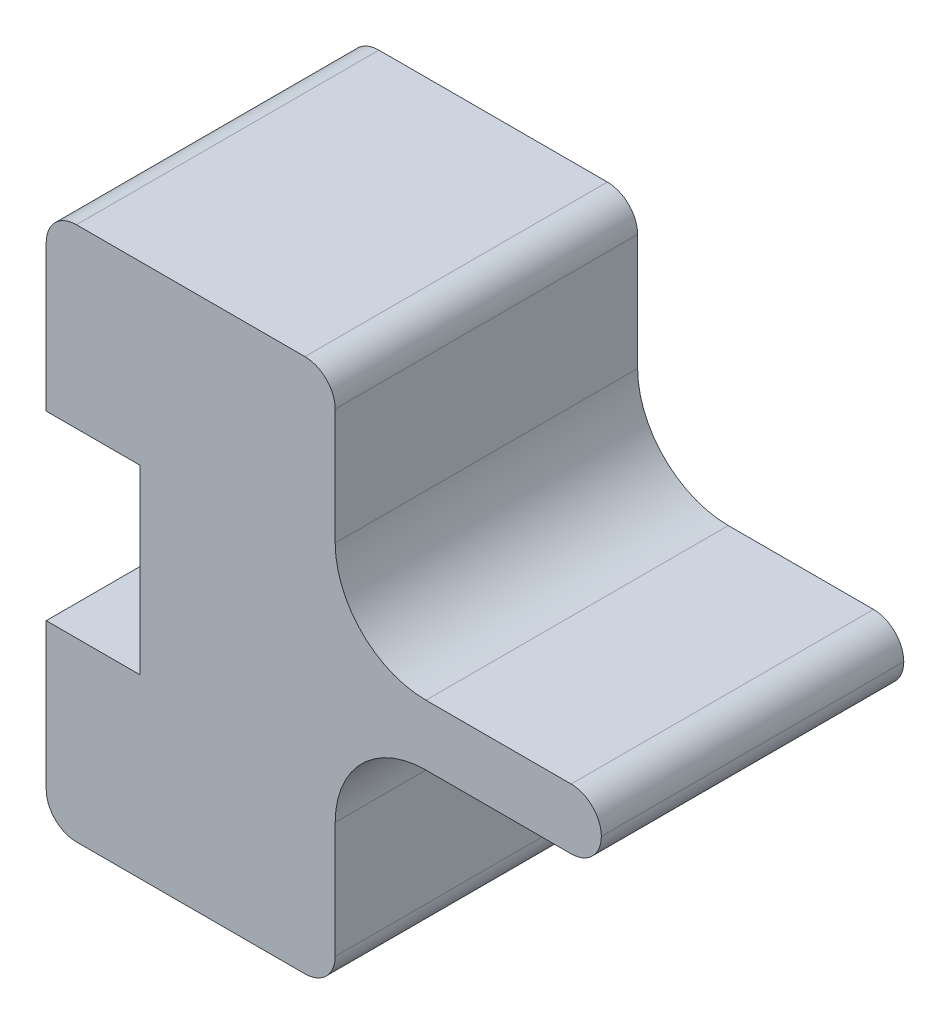
ISO-10303-21;
HEADER;
FILE_DESCRIPTION(('STEP AP214'),'2;1');
FILE_NAME('part.step','',(''),(''),'','','');
FILE_SCHEMA(('AUTOMOTIVE_DESIGN { 1 0 10303 214 1 1 1 1 }'));
ENDSEC;
DATA;
#1=APPLICATION_CONTEXT('core data for automotive mechanical design processes');
#2=APPLICATION_PROTOCOL_DEFINITION('international standard','automotive_design',2000,#1);
#3=PRODUCT_CONTEXT('',#1,'mechanical');
#4=PRODUCT('Part','Part','',(#3));
#5=PRODUCT_RELATED_PRODUCT_CATEGORY('part','',(#4));
#6=PRODUCT_DEFINITION_FORMATION('','',#4);
#7=PRODUCT_DEFINITION_CONTEXT('part definition',#1,'design');
#8=PRODUCT_DEFINITION('design','',#6,#7);
#9=PRODUCT_DEFINITION_SHAPE('','',#8);
#10=(LENGTH_UNIT() NAMED_UNIT(*) SI_UNIT(.MILLI.,.METRE.));
#11=(NAMED_UNIT(*) PLANE_ANGLE_UNIT() SI_UNIT($,.RADIAN.));
#12=(NAMED_UNIT(*) SI_UNIT($,.STERADIAN.) SOLID_ANGLE_UNIT());
#13=UNCERTAINTY_MEASURE_WITH_UNIT(LENGTH_MEASURE(1.E-05),#10,'distance_accuracy_value','');
#14=(GEOMETRIC_REPRESENTATION_CONTEXT(3) GLOBAL_UNCERTAINTY_ASSIGNED_CONTEXT((#13)) GLOBAL_UNIT_ASSIGNED_CONTEXT((#10,
#11,#12)) REPRESENTATION_CONTEXT('',''));
#15=CARTESIAN_POINT('',(0.,0.,0.));
#16=DIRECTION('',(0.,0.,1.));
#17=DIRECTION('',(1.,0.,0.));
#18=AXIS2_PLACEMENT_3D('',#15,#16,#17);
#19=CARTESIAN_POINT('',(-93.5558767753183,30.,100.));
#20=DIRECTION('',(0.,1.,0.));
#21=DIRECTION('',(0.,0.,1.));
#22=AXIS2_PLACEMENT_3D('',#19,#20,#21);
#23=PLANE('',#22);
#24=DIRECTION('',(1.,0.,0.));
#25=VECTOR('',#24,1.);
#26=CARTESIAN_POINT('',(-62.5558767753183,30.,80.));
#27=LINE('',#26,#25);
#28=CARTESIAN_POINT('',(-62.5558767753183,30.,80.));
#29=VERTEX_POINT('',#28);
#30=CARTESIAN_POINT('',(-22.5558767753183,30.,80.));
#31=VERTEX_POINT('',#30);
#32=EDGE_CURVE('E197',#29,#31,#27,.T.);
#33=ORIENTED_EDGE('',*,*,#32,.F.);
#34=DIRECTION('',(0.,0.,-1.));
#35=VECTOR('',#34,1.);
#36=CARTESIAN_POINT('',(-62.5558767753183,30.,80.));
#37=LINE('',#36,#35);
#38=CARTESIAN_POINT('',(-62.5558767753183,30.,100.));
#39=VERTEX_POINT('',#38);
#40=EDGE_CURVE('E182',#39,#29,#37,.T.);
#41=ORIENTED_EDGE('',*,*,#40,.F.);
#42=DIRECTION('',(1.,0.,0.));
#43=VECTOR('',#42,1.);
#44=CARTESIAN_POINT('',(-93.5558767753183,30.,100.));
#45=LINE('',#44,#43);
#46=CARTESIAN_POINT('',(-93.5558767753183,30.,100.));
#47=VERTEX_POINT('',#46);
#48=EDGE_CURVE('E195',#47,#39,#45,.T.);
#49=ORIENTED_EDGE('',*,*,#48,.F.);
#50=DIRECTION('',(0.,0.,-1.));
#51=VECTOR('',#50,1.);
#52=CARTESIAN_POINT('',(-93.5558767753183,30.,100.));
#53=LINE('',#52,#51);
#54=CARTESIAN_POINT('',(-93.5558767753183,30.,0.));
#55=VERTEX_POINT('',#54);
#56=EDGE_CURVE('E319',#47,#55,#53,.T.);
#57=ORIENTED_EDGE('',*,*,#56,.T.);
#58=DIRECTION('',(1.,0.,0.));
#59=VECTOR('',#58,1.);
#60=CARTESIAN_POINT('',(-93.5558767753183,30.,0.));
#61=LINE('',#60,#59);
#62=CARTESIAN_POINT('',(-22.5558767753183,30.,0.));
#63=VERTEX_POINT('',#62);
#64=EDGE_CURVE('E255',#55,#63,#61,.T.);
#65=ORIENTED_EDGE('',*,*,#64,.T.);
#66=DIRECTION('',(0.,0.,-1.));
#67=VECTOR('',#66,1.);
#68=CARTESIAN_POINT('',(-22.5558767753183,30.,100.));
#69=LINE('',#68,#67);
#70=EDGE_CURVE('E316',#31,#63,#69,.T.);
#71=ORIENTED_EDGE('',*,*,#70,.F.);
#72=EDGE_LOOP('',(#33,#41,#49,#57,#65,#71));
#73=FACE_BOUND('',#72,.T.);
#74=ADVANCED_FACE('F39',(#73),#23,.F.);
#75=CARTESIAN_POINT('',(-22.5558767753183,30.,100.));
#76=DIRECTION('',(1.,0.,0.));
#77=DIRECTION('',(0.,0.,-1.));
#78=AXIS2_PLACEMENT_3D('',#75,#76,#77);
#79=PLANE('',#78);
#80=DIRECTION('',(0.,-1.,0.));
#81=VECTOR('',#80,1.);
#82=CARTESIAN_POINT('',(-22.5558767753183,-30.,80.));
#83=LINE('',#82,#81);
#84=CARTESIAN_POINT('',(-22.5558767753183,-30.,80.));
#85=VERTEX_POINT('',#84);
#86=EDGE_CURVE('E189',#31,#85,#83,.T.);
#87=ORIENTED_EDGE('',*,*,#86,.F.);
#88=ORIENTED_EDGE('',*,*,#70,.T.);
#89=DIRECTION('',(0.,-1.,0.));
#90=VECTOR('',#89,1.);
#91=CARTESIAN_POINT('',(-22.5558767753183,30.,0.));
#92=LINE('',#91,#90);
#93=CARTESIAN_POINT('',(-22.5558767753183,-30.,0.));
#94=VERTEX_POINT('',#93);
#95=EDGE_CURVE('E259',#63,#94,#92,.T.);
#96=ORIENTED_EDGE('',*,*,#95,.T.);
#97=DIRECTION('',(0.,0.,-1.));
#98=VECTOR('',#97,1.);
#99=CARTESIAN_POINT('',(-22.5558767753183,-30.,100.));
#100=LINE('',#99,#98);
#101=EDGE_CURVE('E313',#85,#94,#100,.T.);
#102=ORIENTED_EDGE('',*,*,#101,.F.);
#103=EDGE_LOOP('',(#87,#88,#96,#102));
#104=FACE_BOUND('',#103,.T.);
#105=ADVANCED_FACE('F437',(#104),#79,.F.);
#106=CARTESIAN_POINT('',(-93.5558767753183,-30.,100.));
#107=DIRECTION('',(0.,-1.,0.));
#108=DIRECTION('',(0.,0.,-1.));
#109=AXIS2_PLACEMENT_3D('',#106,#107,#108);
#110=PLANE('',#109);
#111=DIRECTION('',(1.,0.,0.));
#112=VECTOR('',#111,1.);
#113=CARTESIAN_POINT('',(-62.5558767753183,-30.,80.));
#114=LINE('',#113,#112);
#115=CARTESIAN_POINT('',(-62.5558767753183,-30.,80.));
#116=VERTEX_POINT('',#115);
#117=EDGE_CURVE('E406',#116,#85,#114,.T.);
#118=ORIENTED_EDGE('',*,*,#117,.T.);
#119=ORIENTED_EDGE('',*,*,#101,.T.);
#120=DIRECTION('',(-1.,0.,0.));
#121=VECTOR('',#120,1.);
#122=CARTESIAN_POINT('',(-93.5558767753183,-30.,0.));
#123=LINE('',#122,#121);
#124=CARTESIAN_POINT('',(-93.5558767753183,-30.,0.));
#125=VERTEX_POINT('',#124);
#126=EDGE_CURVE('E263',#94,#125,#123,.T.);
#127=ORIENTED_EDGE('',*,*,#126,.T.);
#128=DIRECTION('',(0.,0.,-1.));
#129=VECTOR('',#128,1.);
#130=CARTESIAN_POINT('',(-93.5558767753183,-30.,100.));
#131=LINE('',#130,#129);
#132=CARTESIAN_POINT('',(-93.5558767753183,-30.,100.));
#133=VERTEX_POINT('',#132);
#134=EDGE_CURVE('E309',#133,#125,#131,.T.);
#135=ORIENTED_EDGE('',*,*,#134,.F.);
#136=DIRECTION('',(-1.,0.,0.));
#137=VECTOR('',#136,1.);
#138=CARTESIAN_POINT('',(-93.5558767753183,-30.,100.));
#139=LINE('',#138,#137);
#140=CARTESIAN_POINT('',(-62.5558767753183,-30.,100.));
#141=VERTEX_POINT('',#140);
#142=EDGE_CURVE('E206',#141,#133,#139,.T.);
#143=ORIENTED_EDGE('',*,*,#142,.F.);
#144=DIRECTION('',(0.,0.,1.));
#145=VECTOR('',#144,1.);
#146=CARTESIAN_POINT('',(-62.5558767753183,-30.,80.));
#147=LINE('',#146,#145);
#148=EDGE_CURVE('E185',#116,#141,#147,.T.);
#149=ORIENTED_EDGE('',*,*,#148,.F.);
#150=EDGE_LOOP('',(#118,#119,#127,#135,#143,#149));
#151=FACE_BOUND('',#150,.T.);
#152=ADVANCED_FACE('F439',(#151),#110,.F.);
#153=CARTESIAN_POINT('',(31.994888515754,40.,100.));
#154=DIRECTION('',(0.,0.,-1.));
#155=DIRECTION('',(-1.,0.,0.));
#156=AXIS2_PLACEMENT_3D('',#153,#154,#155);
#157=CYLINDRICAL_SURFACE('',#156,30.);
#158=CARTESIAN_POINT('',(31.994888515754,40.,0.));
#159=DIRECTION('',(0.,0.,-1.));
#160=DIRECTION('',(-1.,0.,0.));
#161=AXIS2_PLACEMENT_3D('',#158,#159,#160);
#162=CIRCLE('',#161,30.);
#163=CARTESIAN_POINT('',(31.9948885157542,10.,0.));
#164=VERTEX_POINT('',#163);
#165=CARTESIAN_POINT('',(1.99488851575401,40.0000000000002,0.));
#166=VERTEX_POINT('',#165);
#167=EDGE_CURVE('E238',#164,#166,#162,.T.);
#168=ORIENTED_EDGE('',*,*,#167,.T.);
#169=DIRECTION('',(0.,0.,-1.));
#170=VECTOR('',#169,1.);
#171=CARTESIAN_POINT('',(1.99488851575401,40.0000000000002,100.));
#172=LINE('',#171,#170);
#173=CARTESIAN_POINT('',(1.99488851575401,40.0000000000002,100.));
#174=VERTEX_POINT('',#173);
#175=EDGE_CURVE('E330',#174,#166,#172,.T.);
#176=ORIENTED_EDGE('',*,*,#175,.F.);
#177=CARTESIAN_POINT('',(31.994888515754,40.,100.));
#178=DIRECTION('',(0.,0.,-1.));
#179=DIRECTION('',(-1.,0.,0.));
#180=AXIS2_PLACEMENT_3D('',#177,#178,#179);
#181=CIRCLE('',#180,30.);
#182=CARTESIAN_POINT('',(31.9948885157542,10.,100.));
#183=VERTEX_POINT('',#182);
#184=EDGE_CURVE('E289',#183,#174,#181,.T.);
#185=ORIENTED_EDGE('',*,*,#184,.F.);
#186=DIRECTION('',(0.,0.,-1.));
#187=VECTOR('',#186,1.);
#188=CARTESIAN_POINT('',(31.9948885157542,10.,100.));
#189=LINE('',#188,#187);
#190=EDGE_CURVE('E237',#183,#164,#189,.T.);
#191=ORIENTED_EDGE('',*,*,#190,.T.);
#192=EDGE_LOOP('',(#168,#176,#185,#191));
#193=FACE_BOUND('',#192,.T.);
#194=ADVANCED_FACE('F474',(#193),#157,.F.);
#195=CARTESIAN_POINT('',(1.99488851575401,40.0000000000002,100.));
#196=DIRECTION('',(-1.,0.,0.));
#197=DIRECTION('',(0.,0.,1.));
#198=AXIS2_PLACEMENT_3D('',#195,#196,#197);
#199=PLANE('',#198);
#200=DIRECTION('',(0.,1.,0.));
#201=VECTOR('',#200,1.);
#202=CARTESIAN_POINT('',(1.99488851575401,40.0000000000002,0.));
#203=LINE('',#202,#201);
#204=CARTESIAN_POINT('',(1.99488851575401,78.3750656119091,0.));
#205=VERTEX_POINT('',#204);
#206=EDGE_CURVE('E242',#166,#205,#203,.T.);
#207=ORIENTED_EDGE('',*,*,#206,.T.);
#208=DIRECTION('',(0.,0.,-1.));
#209=VECTOR('',#208,1.);
#210=CARTESIAN_POINT('',(1.99488851575401,78.3750656119091,100.));
#211=LINE('',#210,#209);
#212=CARTESIAN_POINT('',(1.99488851575401,78.3750656119091,100.));
#213=VERTEX_POINT('',#212);
#214=EDGE_CURVE('E354',#205,#213,#211,.F.);
#215=ORIENTED_EDGE('',*,*,#214,.T.);
#216=DIRECTION('',(0.,1.,0.));
#217=VECTOR('',#216,1.);
#218=CARTESIAN_POINT('',(1.99488851575401,40.0000000000002,100.));
#219=LINE('',#218,#217);
#220=EDGE_CURVE('E414',#174,#213,#219,.T.);
#221=ORIENTED_EDGE('',*,*,#220,.F.);
#222=ORIENTED_EDGE('',*,*,#175,.T.);
#223=EDGE_LOOP('',(#207,#215,#221,#222));
#224=FACE_BOUND('',#223,.T.);
#225=ADVANCED_FACE('F470',(#224),#199,.F.);
#226=CARTESIAN_POINT('',(1.99488851575401,88.3750656119091,100.));
#227=DIRECTION('',(0.,-1.,0.));
#228=DIRECTION('',(1.,0.,0.));
#229=AXIS2_PLACEMENT_3D('',#226,#227,#228);
#230=PLANE('',#229);
#231=DIRECTION('',(-1.,0.,0.));
#232=VECTOR('',#231,1.);
#233=CARTESIAN_POINT('',(1.99488851575401,88.3750656119091,100.));
#234=LINE('',#233,#232);
#235=CARTESIAN_POINT('',(-8.00511148424599,88.3750656119091,100.));
#236=VERTEX_POINT('',#235);
#237=CARTESIAN_POINT('',(-83.5558767753183,88.3750656119091,100.));
#238=VERTEX_POINT('',#237);
#239=EDGE_CURVE('E418',#236,#238,#234,.T.);
#240=ORIENTED_EDGE('',*,*,#239,.F.);
#241=DIRECTION('',(0.,0.,-1.));
#242=VECTOR('',#241,1.);
#243=CARTESIAN_POINT('',(-8.00511148424599,88.3750656119091,100.));
#244=LINE('',#243,#242);
#245=CARTESIAN_POINT('',(-8.00511148424599,88.3750656119091,0.));
#246=VERTEX_POINT('',#245);
#247=EDGE_CURVE('E347',#236,#246,#244,.T.);
#248=ORIENTED_EDGE('',*,*,#247,.T.);
#249=DIRECTION('',(-1.,0.,0.));
#250=VECTOR('',#249,1.);
#251=CARTESIAN_POINT('',(1.99488851575401,88.3750656119091,0.));
#252=LINE('',#251,#250);
#253=CARTESIAN_POINT('',(-83.5558767753183,88.3750656119091,0.));
#254=VERTEX_POINT('',#253);
#255=EDGE_CURVE('E246',#246,#254,#252,.T.);
#256=ORIENTED_EDGE('',*,*,#255,.T.);
#257=DIRECTION('',(0.,0.,-1.));
#258=VECTOR('',#257,1.);
#259=CARTESIAN_POINT('',(-83.5558767753183,88.3750656119091,100.));
#260=LINE('',#259,#258);
#261=EDGE_CURVE('E326',#238,#254,#260,.T.);
#262=ORIENTED_EDGE('',*,*,#261,.F.);
#263=EDGE_LOOP('',(#240,#248,#256,#262));
#264=FACE_BOUND('',#263,.T.);
#265=ADVANCED_FACE('F467',(#264),#230,.F.);
#266=CARTESIAN_POINT('',(-83.5558767753183,78.3750656119091,100.));
#267=DIRECTION('',(0.,0.,-1.));
#268=DIRECTION('',(-1.,0.,0.));
#269=AXIS2_PLACEMENT_3D('',#266,#267,#268);
#270=CYLINDRICAL_SURFACE('',#269,9.99999999999999);
#271=CARTESIAN_POINT('',(-83.5558767753183,78.3750656119091,0.));
#272=DIRECTION('',(0.,0.,1.));
#273=DIRECTION('',(1.,0.,0.));
#274=AXIS2_PLACEMENT_3D('',#271,#272,#273);
#275=CIRCLE('',#274,9.99999999999999);
#276=CARTESIAN_POINT('',(-93.5558767753183,78.3750656119091,0.));
#277=VERTEX_POINT('',#276);
#278=EDGE_CURVE('E249',#254,#277,#275,.T.);
#279=ORIENTED_EDGE('',*,*,#278,.T.);
#280=DIRECTION('',(0.,0.,-1.));
#281=VECTOR('',#280,1.);
#282=CARTESIAN_POINT('',(-93.5558767753183,78.3750656119091,100.));
#283=LINE('',#282,#281);
#284=CARTESIAN_POINT('',(-93.5558767753183,78.3750656119091,100.));
#285=VERTEX_POINT('',#284);
#286=EDGE_CURVE('E322',#285,#277,#283,.T.);
#287=ORIENTED_EDGE('',*,*,#286,.F.);
#288=CARTESIAN_POINT('',(-83.5558767753183,78.3750656119091,100.));
#289=DIRECTION('',(0.,0.,1.));
#290=DIRECTION('',(1.,0.,0.));
#291=AXIS2_PLACEMENT_3D('',#288,#289,#290);
#292=CIRCLE('',#291,9.99999999999999);
#293=EDGE_CURVE('E212',#238,#285,#292,.T.);
#294=ORIENTED_EDGE('',*,*,#293,.F.);
#295=ORIENTED_EDGE('',*,*,#261,.T.);
#296=EDGE_LOOP('',(#279,#287,#294,#295));
#297=FACE_BOUND('',#296,.T.);
#298=ADVANCED_FACE('F426',(#297),#270,.T.);
#299=CARTESIAN_POINT('',(-93.5558767753183,78.3750656119091,100.));
#300=DIRECTION('',(1.,0.,0.));
#301=DIRECTION('',(0.,1.,0.));
#302=AXIS2_PLACEMENT_3D('',#299,#300,#301);
#303=PLANE('',#302);
#304=DIRECTION('',(0.,-1.,0.));
#305=VECTOR('',#304,1.);
#306=CARTESIAN_POINT('',(-93.5558767753183,78.3750656119091,0.));
#307=LINE('',#306,#305);
#308=EDGE_CURVE('E252',#277,#55,#307,.T.);
#309=ORIENTED_EDGE('',*,*,#308,.T.);
#310=ORIENTED_EDGE('',*,*,#56,.F.);
#311=DIRECTION('',(0.,-1.,0.));
#312=VECTOR('',#311,1.);
#313=CARTESIAN_POINT('',(-93.5558767753183,78.3750656119091,100.));
#314=LINE('',#313,#312);
#315=EDGE_CURVE('E203',#285,#47,#314,.T.);
#316=ORIENTED_EDGE('',*,*,#315,.F.);
#317=ORIENTED_EDGE('',*,*,#286,.T.);
#318=EDGE_LOOP('',(#309,#310,#316,#317));
#319=FACE_BOUND('',#318,.T.);
#320=ADVANCED_FACE('F430',(#319),#303,.F.);
#321=CARTESIAN_POINT('',(-93.5558767753183,-78.3750656119091,100.));
#322=DIRECTION('',(1.,0.,0.));
#323=DIRECTION('',(0.,1.,0.));
#324=AXIS2_PLACEMENT_3D('',#321,#322,#323);
#325=PLANE('',#324);
#326=DIRECTION('',(0.,-1.,0.));
#327=VECTOR('',#326,1.);
#328=CARTESIAN_POINT('',(-93.5558767753183,-78.3750656119091,0.));
#329=LINE('',#328,#327);
#330=CARTESIAN_POINT('',(-93.5558767753183,-78.3750656119091,0.));
#331=VERTEX_POINT('',#330);
#332=EDGE_CURVE('E266',#125,#331,#329,.T.);
#333=ORIENTED_EDGE('',*,*,#332,.T.);
#334=DIRECTION('',(0.,0.,-1.));
#335=VECTOR('',#334,1.);
#336=CARTESIAN_POINT('',(-93.5558767753183,-78.3750656119091,100.));
#337=LINE('',#336,#335);
#338=CARTESIAN_POINT('',(-93.5558767753183,-78.3750656119091,100.));
#339=VERTEX_POINT('',#338);
#340=EDGE_CURVE('E305',#339,#331,#337,.T.);
#341=ORIENTED_EDGE('',*,*,#340,.F.);
#342=DIRECTION('',(0.,-1.,0.));
#343=VECTOR('',#342,1.);
#344=CARTESIAN_POINT('',(-93.5558767753183,-78.3750656119091,100.));
#345=LINE('',#344,#343);
#346=EDGE_CURVE('E210',#133,#339,#345,.T.);
#347=ORIENTED_EDGE('',*,*,#346,.F.);
#348=ORIENTED_EDGE('',*,*,#134,.T.);
#349=EDGE_LOOP('',(#333,#341,#347,#348));
#350=FACE_BOUND('',#349,.T.);
#351=ADVANCED_FACE('F464',(#350),#325,.F.);
#352=CARTESIAN_POINT('',(-83.5558767753183,-78.3750656119091,100.));
#353=DIRECTION('',(0.,0.,-1.));
#354=DIRECTION('',(-1.,0.,0.));
#355=AXIS2_PLACEMENT_3D('',#352,#353,#354);
#356=CYLINDRICAL_SURFACE('',#355,9.99999999999999);
#357=CARTESIAN_POINT('',(-83.5558767753183,-78.3750656119091,0.));
#358=DIRECTION('',(0.,0.,1.));
#359=DIRECTION('',(1.,0.,0.));
#360=AXIS2_PLACEMENT_3D('',#357,#358,#359);
#361=CIRCLE('',#360,9.99999999999999);
#362=CARTESIAN_POINT('',(-83.5558767753183,-88.3750656119091,0.));
#363=VERTEX_POINT('',#362);
#364=EDGE_CURVE('E269',#331,#363,#361,.T.);
#365=ORIENTED_EDGE('',*,*,#364,.T.);
#366=DIRECTION('',(0.,0.,-1.));
#367=VECTOR('',#366,1.);
#368=CARTESIAN_POINT('',(-83.5558767753183,-88.3750656119091,100.));
#369=LINE('',#368,#367);
#370=CARTESIAN_POINT('',(-83.5558767753183,-88.3750656119091,100.));
#371=VERTEX_POINT('',#370);
#372=EDGE_CURVE('E301',#371,#363,#369,.T.);
#373=ORIENTED_EDGE('',*,*,#372,.F.);
#374=CARTESIAN_POINT('',(-83.5558767753183,-78.3750656119091,100.));
#375=DIRECTION('',(0.,0.,1.));
#376=DIRECTION('',(1.,0.,0.));
#377=AXIS2_PLACEMENT_3D('',#374,#375,#376);
#378=CIRCLE('',#377,9.99999999999999);
#379=EDGE_CURVE('E218',#339,#371,#378,.T.);
#380=ORIENTED_EDGE('',*,*,#379,.F.);
#381=ORIENTED_EDGE('',*,*,#340,.T.);
#382=EDGE_LOOP('',(#365,#373,#380,#381));
#383=FACE_BOUND('',#382,.T.);
#384=ADVANCED_FACE('F519',(#383),#356,.T.);
#385=CARTESIAN_POINT('',(1.99488851575401,-88.3750656119091,100.));
#386=DIRECTION('',(0.,1.,0.));
#387=DIRECTION('',(-1.,0.,0.));
#388=AXIS2_PLACEMENT_3D('',#385,#386,#387);
#389=PLANE('',#388);
#390=DIRECTION('',(1.,0.,0.));
#391=VECTOR('',#390,1.);
#392=CARTESIAN_POINT('',(1.99488851575401,-88.3750656119091,0.));
#393=LINE('',#392,#391);
#394=CARTESIAN_POINT('',(-8.00511148424599,-88.3750656119091,0.));
#395=VERTEX_POINT('',#394);
#396=EDGE_CURVE('E272',#363,#395,#393,.T.);
#397=ORIENTED_EDGE('',*,*,#396,.T.);
#398=DIRECTION('',(0.,0.,-1.));
#399=VECTOR('',#398,1.);
#400=CARTESIAN_POINT('',(-8.00511148424599,-88.3750656119091,100.));
#401=LINE('',#400,#399);
#402=CARTESIAN_POINT('',(-8.00511148424599,-88.3750656119091,100.));
#403=VERTEX_POINT('',#402);
#404=EDGE_CURVE('E341',#395,#403,#401,.F.);
#405=ORIENTED_EDGE('',*,*,#404,.T.);
#406=DIRECTION('',(1.,0.,0.));
#407=VECTOR('',#406,1.);
#408=CARTESIAN_POINT('',(1.99488851575401,-88.3750656119091,100.));
#409=LINE('',#408,#407);
#410=EDGE_CURVE('E221',#371,#403,#409,.T.);
#411=ORIENTED_EDGE('',*,*,#410,.F.);
#412=ORIENTED_EDGE('',*,*,#372,.T.);
#413=EDGE_LOOP('',(#397,#405,#411,#412));
#414=FACE_BOUND('',#413,.T.);
#415=ADVANCED_FACE('F515',(#414),#389,.F.);
#416=CARTESIAN_POINT('',(1.99488851575401,-40.0000000000002,100.));
#417=DIRECTION('',(-1.,0.,0.));
#418=DIRECTION('',(0.,0.,1.));
#419=AXIS2_PLACEMENT_3D('',#416,#417,#418);
#420=PLANE('',#419);
#421=DIRECTION('',(0.,1.,0.));
#422=VECTOR('',#421,1.);
#423=CARTESIAN_POINT('',(1.99488851575401,-40.0000000000002,100.));
#424=LINE('',#423,#422);
#425=CARTESIAN_POINT('',(1.99488851575401,-78.3750656119091,100.));
#426=VERTEX_POINT('',#425);
#427=CARTESIAN_POINT('',(1.99488851575401,-40.0000000000002,100.));
#428=VERTEX_POINT('',#427);
#429=EDGE_CURVE('E225',#426,#428,#424,.T.);
#430=ORIENTED_EDGE('',*,*,#429,.F.);
#431=DIRECTION('',(0.,0.,-1.));
#432=VECTOR('',#431,1.);
#433=CARTESIAN_POINT('',(1.99488851575401,-78.3750656119091,100.));
#434=LINE('',#433,#432);
#435=CARTESIAN_POINT('',(1.99488851575401,-78.3750656119091,0.));
#436=VERTEX_POINT('',#435);
#437=EDGE_CURVE('E334',#426,#436,#434,.T.);
#438=ORIENTED_EDGE('',*,*,#437,.T.);
#439=DIRECTION('',(0.,1.,0.));
#440=VECTOR('',#439,1.);
#441=CARTESIAN_POINT('',(1.99488851575401,-40.0000000000002,0.));
#442=LINE('',#441,#440);
#443=CARTESIAN_POINT('',(1.99488851575401,-40.0000000000002,0.));
#444=VERTEX_POINT('',#443);
#445=EDGE_CURVE('E276',#436,#444,#442,.T.);
#446=ORIENTED_EDGE('',*,*,#445,.T.);
#447=DIRECTION('',(0.,0.,-1.));
#448=VECTOR('',#447,1.);
#449=CARTESIAN_POINT('',(1.99488851575401,-40.0000000000002,100.));
#450=LINE('',#449,#448);
#451=EDGE_CURVE('E297',#428,#444,#450,.T.);
#452=ORIENTED_EDGE('',*,*,#451,.F.);
#453=EDGE_LOOP('',(#430,#438,#446,#452));
#454=FACE_BOUND('',#453,.T.);
#455=ADVANCED_FACE('F512',(#454),#420,.F.);
#456=CARTESIAN_POINT('',(31.994888515754,-40.,100.));
#457=DIRECTION('',(0.,0.,-1.));
#458=DIRECTION('',(-1.,0.,0.));
#459=AXIS2_PLACEMENT_3D('',#456,#457,#458);
#460=CYLINDRICAL_SURFACE('',#459,30.);
#461=CARTESIAN_POINT('',(31.994888515754,-40.,0.));
#462=DIRECTION('',(0.,0.,-1.));
#463=DIRECTION('',(-1.,0.,0.));
#464=AXIS2_PLACEMENT_3D('',#461,#462,#463);
#465=CIRCLE('',#464,30.);
#466=CARTESIAN_POINT('',(31.9948885157542,-10.,0.));
#467=VERTEX_POINT('',#466);
#468=EDGE_CURVE('E279',#444,#467,#465,.T.);
#469=ORIENTED_EDGE('',*,*,#468,.T.);
#470=DIRECTION('',(0.,0.,-1.));
#471=VECTOR('',#470,1.);
#472=CARTESIAN_POINT('',(31.9948885157542,-10.,100.));
#473=LINE('',#472,#471);
#474=CARTESIAN_POINT('',(31.9948885157542,-10.,100.));
#475=VERTEX_POINT('',#474);
#476=EDGE_CURVE('E293',#475,#467,#473,.T.);
#477=ORIENTED_EDGE('',*,*,#476,.F.);
#478=CARTESIAN_POINT('',(31.994888515754,-40.,100.));
#479=DIRECTION('',(0.,0.,-1.));
#480=DIRECTION('',(-1.,0.,0.));
#481=AXIS2_PLACEMENT_3D('',#478,#479,#480);
#482=CIRCLE('',#481,30.);
#483=EDGE_CURVE('E228',#428,#475,#482,.T.);
#484=ORIENTED_EDGE('',*,*,#483,.F.);
#485=ORIENTED_EDGE('',*,*,#451,.T.);
#486=EDGE_LOOP('',(#469,#477,#484,#485));
#487=FACE_BOUND('',#486,.T.);
#488=ADVANCED_FACE('F385',(#487),#460,.F.);
#489=CARTESIAN_POINT('',(90.,-10.,100.));
#490=DIRECTION('',(0.,1.,0.));
#491=DIRECTION('',(-1.,0.,0.));
#492=AXIS2_PLACEMENT_3D('',#489,#490,#491);
#493=PLANE('',#492);
#494=DIRECTION('',(1.,0.,0.));
#495=VECTOR('',#494,1.);
#496=CARTESIAN_POINT('',(90.,-10.,0.));
#497=LINE('',#496,#495);
#498=CARTESIAN_POINT('',(80.,-10.,0.));
#499=VERTEX_POINT('',#498);
#500=EDGE_CURVE('E282',#467,#499,#497,.T.);
#501=ORIENTED_EDGE('',*,*,#500,.T.);
#502=DIRECTION('',(0.,0.,-1.));
#503=VECTOR('',#502,1.);
#504=CARTESIAN_POINT('',(80.,-10.,100.));
#505=LINE('',#504,#503);
#506=CARTESIAN_POINT('',(80.,-10.,100.));
#507=VERTEX_POINT('',#506);
#508=EDGE_CURVE('E366',#499,#507,#505,.F.);
#509=ORIENTED_EDGE('',*,*,#508,.T.);
#510=DIRECTION('',(1.,0.,0.));
#511=VECTOR('',#510,1.);
#512=CARTESIAN_POINT('',(90.,-10.,100.));
#513=LINE('',#512,#511);
#514=EDGE_CURVE('E231',#475,#507,#513,.T.);
#515=ORIENTED_EDGE('',*,*,#514,.F.);
#516=ORIENTED_EDGE('',*,*,#476,.T.);
#517=EDGE_LOOP('',(#501,#509,#515,#516));
#518=FACE_BOUND('',#517,.T.);
#519=ADVANCED_FACE('F376',(#518),#493,.F.);
#520=CARTESIAN_POINT('',(90.,10.,100.));
#521=DIRECTION('',(0.,-1.,0.));
#522=DIRECTION('',(1.,0.,0.));
#523=AXIS2_PLACEMENT_3D('',#520,#521,#522);
#524=PLANE('',#523);
#525=DIRECTION('',(-1.,0.,0.));
#526=VECTOR('',#525,1.);
#527=CARTESIAN_POINT('',(90.,10.,100.));
#528=LINE('',#527,#526);
#529=CARTESIAN_POINT('',(80.,10.,100.));
#530=VERTEX_POINT('',#529);
#531=EDGE_CURVE('E234',#530,#183,#528,.T.);
#532=ORIENTED_EDGE('',*,*,#531,.F.);
#533=DIRECTION('',(0.,0.,-1.));
#534=VECTOR('',#533,1.);
#535=CARTESIAN_POINT('',(80.,10.,100.));
#536=LINE('',#535,#534);
#537=CARTESIAN_POINT('',(80.,10.,0.));
#538=VERTEX_POINT('',#537);
#539=EDGE_CURVE('E11',#530,#538,#536,.T.);
#540=ORIENTED_EDGE('',*,*,#539,.T.);
#541=DIRECTION('',(-1.,0.,0.));
#542=VECTOR('',#541,1.);
#543=CARTESIAN_POINT('',(90.,10.,0.));
#544=LINE('',#543,#542);
#545=EDGE_CURVE('E286',#538,#164,#544,.T.);
#546=ORIENTED_EDGE('',*,*,#545,.T.);
#547=ORIENTED_EDGE('',*,*,#190,.F.);
#548=EDGE_LOOP('',(#532,#540,#546,#547));
#549=FACE_BOUND('',#548,.T.);
#550=ADVANCED_FACE('F493',(#549),#524,.F.);
#551=CARTESIAN_POINT('',(31.994888515754,40.,100.));
#552=DIRECTION('',(0.,0.,-1.));
#553=DIRECTION('',(-1.,0.,0.));
#554=AXIS2_PLACEMENT_3D('',#551,#552,#553);
#555=PLANE('',#554);
#556=ORIENTED_EDGE('',*,*,#514,.T.);
#557=CARTESIAN_POINT('',(80.,0.,100.));
#558=DIRECTION('',(0.,0.,-1.));
#559=DIRECTION('',(-1.,0.,0.));
#560=AXIS2_PLACEMENT_3D('',#557,#558,#559);
#561=CIRCLE('',#560,10.);
#562=CARTESIAN_POINT('',(90.,0.,100.));
#563=VERTEX_POINT('',#562);
#564=EDGE_CURVE('E49',#507,#563,#561,.F.);
#565=ORIENTED_EDGE('',*,*,#564,.T.);
#566=CARTESIAN_POINT('',(80.,0.,100.));
#567=DIRECTION('',(0.,0.,-1.));
#568=DIRECTION('',(-1.,0.,0.));
#569=AXIS2_PLACEMENT_3D('',#566,#567,#568);
#570=CIRCLE('',#569,10.);
#571=EDGE_CURVE('E56',#563,#530,#570,.F.);
#572=ORIENTED_EDGE('',*,*,#571,.T.);
#573=ORIENTED_EDGE('',*,*,#531,.T.);
#574=ORIENTED_EDGE('',*,*,#184,.T.);
#575=ORIENTED_EDGE('',*,*,#220,.T.);
#576=CARTESIAN_POINT('',(-8.00511148424599,78.3750656119091,100.));
#577=DIRECTION('',(0.,0.,-1.));
#578=DIRECTION('',(-1.,0.,0.));
#579=AXIS2_PLACEMENT_3D('',#576,#577,#578);
#580=CIRCLE('',#579,10.);
#581=EDGE_CURVE('E357',#213,#236,#580,.F.);
#582=ORIENTED_EDGE('',*,*,#581,.T.);
#583=ORIENTED_EDGE('',*,*,#239,.T.);
#584=ORIENTED_EDGE('',*,*,#293,.T.);
#585=ORIENTED_EDGE('',*,*,#315,.T.);
#586=ORIENTED_EDGE('',*,*,#48,.T.);
#587=DIRECTION('',(0.,1.,0.));
#588=VECTOR('',#587,1.);
#589=CARTESIAN_POINT('',(-62.5558767753183,-30.,100.));
#590=LINE('',#589,#588);
#591=EDGE_CURVE('E179',#141,#39,#590,.T.);
#592=ORIENTED_EDGE('',*,*,#591,.F.);
#593=ORIENTED_EDGE('',*,*,#142,.T.);
#594=ORIENTED_EDGE('',*,*,#346,.T.);
#595=ORIENTED_EDGE('',*,*,#379,.T.);
#596=ORIENTED_EDGE('',*,*,#410,.T.);
#597=CARTESIAN_POINT('',(-8.00511148424599,-78.3750656119091,100.));
#598=DIRECTION('',(0.,0.,-1.));
#599=DIRECTION('',(-1.,0.,0.));
#600=AXIS2_PLACEMENT_3D('',#597,#598,#599);
#601=CIRCLE('',#600,10.);
#602=EDGE_CURVE('E344',#403,#426,#601,.F.);
#603=ORIENTED_EDGE('',*,*,#602,.T.);
#604=ORIENTED_EDGE('',*,*,#429,.T.);
#605=ORIENTED_EDGE('',*,*,#483,.T.);
#606=EDGE_LOOP('',(#556,#565,#572,#573,#574,#575,#582,#583,#584,#585,#586,#592,#593,#594,#595,
#596,#603,#604,#605));
#607=FACE_BOUND('',#606,.T.);
#608=ADVANCED_FACE('F201',(#607),#555,.F.);
#609=CARTESIAN_POINT('',(31.994888515754,40.,0.));
#610=DIRECTION('',(0.,0.,-1.));
#611=DIRECTION('',(-1.,0.,0.));
#612=AXIS2_PLACEMENT_3D('',#609,#610,#611);
#613=PLANE('',#612);
#614=CARTESIAN_POINT('',(80.,0.,0.));
#615=DIRECTION('',(0.,0.,-1.));
#616=DIRECTION('',(-1.,0.,0.));
#617=AXIS2_PLACEMENT_3D('',#614,#615,#616);
#618=CIRCLE('',#617,10.);
#619=CARTESIAN_POINT('',(90.,0.,0.));
#620=VERTEX_POINT('',#619);
#621=EDGE_CURVE('E360',#538,#620,#618,.T.);
#622=ORIENTED_EDGE('',*,*,#621,.T.);
#623=CARTESIAN_POINT('',(80.,0.,0.));
#624=DIRECTION('',(0.,0.,-1.));
#625=DIRECTION('',(-1.,0.,0.));
#626=AXIS2_PLACEMENT_3D('',#623,#624,#625);
#627=CIRCLE('',#626,10.);
#628=EDGE_CURVE('E363',#620,#499,#627,.T.);
#629=ORIENTED_EDGE('',*,*,#628,.T.);
#630=ORIENTED_EDGE('',*,*,#500,.F.);
#631=ORIENTED_EDGE('',*,*,#468,.F.);
#632=ORIENTED_EDGE('',*,*,#445,.F.);
#633=CARTESIAN_POINT('',(-8.00511148424599,-78.3750656119091,0.));
#634=DIRECTION('',(0.,0.,-1.));
#635=DIRECTION('',(-1.,0.,0.));
#636=AXIS2_PLACEMENT_3D('',#633,#634,#635);
#637=CIRCLE('',#636,10.);
#638=EDGE_CURVE('E338',#436,#395,#637,.T.);
#639=ORIENTED_EDGE('',*,*,#638,.T.);
#640=ORIENTED_EDGE('',*,*,#396,.F.);
#641=ORIENTED_EDGE('',*,*,#364,.F.);
#642=ORIENTED_EDGE('',*,*,#332,.F.);
#643=ORIENTED_EDGE('',*,*,#126,.F.);
#644=ORIENTED_EDGE('',*,*,#95,.F.);
#645=ORIENTED_EDGE('',*,*,#64,.F.);
#646=ORIENTED_EDGE('',*,*,#308,.F.);
#647=ORIENTED_EDGE('',*,*,#278,.F.);
#648=ORIENTED_EDGE('',*,*,#255,.F.);
#649=CARTESIAN_POINT('',(-8.00511148424599,78.3750656119091,0.));
#650=DIRECTION('',(0.,0.,-1.));
#651=DIRECTION('',(-1.,0.,0.));
#652=AXIS2_PLACEMENT_3D('',#649,#650,#651);
#653=CIRCLE('',#652,10.);
#654=EDGE_CURVE('E351',#246,#205,#653,.T.);
#655=ORIENTED_EDGE('',*,*,#654,.T.);
#656=ORIENTED_EDGE('',*,*,#206,.F.);
#657=ORIENTED_EDGE('',*,*,#167,.F.);
#658=ORIENTED_EDGE('',*,*,#545,.F.);
#659=EDGE_LOOP('',(#622,#629,#630,#631,#632,#639,#640,#641,#642,#643,#644,#645,#646,#647,#648,
#655,#656,#657,#658));
#660=FACE_BOUND('',#659,.T.);
#661=ADVANCED_FACE('F388',(#660),#613,.T.);
#662=CARTESIAN_POINT('',(-62.5558767753183,-30.,80.));
#663=DIRECTION('',(0.,0.,1.));
#664=DIRECTION('',(1.,0.,0.));
#665=AXIS2_PLACEMENT_3D('',#662,#663,#664);
#666=PLANE('',#665);
#667=ORIENTED_EDGE('',*,*,#86,.T.);
#668=ORIENTED_EDGE('',*,*,#117,.F.);
#669=DIRECTION('',(0.,-1.,0.));
#670=VECTOR('',#669,1.);
#671=CARTESIAN_POINT('',(-62.5558767753183,-30.,80.));
#672=LINE('',#671,#670);
#673=EDGE_CURVE('E199',#29,#116,#672,.T.);
#674=ORIENTED_EDGE('',*,*,#673,.F.);
#675=ORIENTED_EDGE('',*,*,#32,.T.);
#676=EDGE_LOOP('',(#667,#668,#674,#675));
#677=FACE_BOUND('',#676,.T.);
#678=ADVANCED_FACE('F441',(#677),#666,.F.);
#679=CARTESIAN_POINT('',(-62.5558767753183,0.,0.));
#680=DIRECTION('',(1.,0.,0.));
#681=DIRECTION('',(0.,0.,-1.));
#682=AXIS2_PLACEMENT_3D('',#679,#680,#681);
#683=PLANE('',#682);
#684=ORIENTED_EDGE('',*,*,#591,.T.);
#685=ORIENTED_EDGE('',*,*,#40,.T.);
#686=ORIENTED_EDGE('',*,*,#673,.T.);
#687=ORIENTED_EDGE('',*,*,#148,.T.);
#688=EDGE_LOOP('',(#684,#685,#686,#687));
#689=FACE_BOUND('',#688,.T.);
#690=ADVANCED_FACE('F181',(#689),#683,.F.);
#691=CARTESIAN_POINT('',(-8.00511148424599,-78.3750656119091,100.));
#692=DIRECTION('',(0.,0.,-1.));
#693=DIRECTION('',(-1.,0.,0.));
#694=AXIS2_PLACEMENT_3D('',#691,#692,#693);
#695=CYLINDRICAL_SURFACE('',#694,10.);
#696=ORIENTED_EDGE('',*,*,#602,.F.);
#697=ORIENTED_EDGE('',*,*,#404,.F.);
#698=ORIENTED_EDGE('',*,*,#638,.F.);
#699=ORIENTED_EDGE('',*,*,#437,.F.);
#700=EDGE_LOOP('',(#696,#697,#698,#699));
#701=FACE_BOUND('',#700,.T.);
#702=ADVANCED_FACE('F450',(#701),#695,.T.);
#703=CARTESIAN_POINT('',(-8.00511148424599,78.3750656119091,100.));
#704=DIRECTION('',(0.,0.,-1.));
#705=DIRECTION('',(-1.,0.,0.));
#706=AXIS2_PLACEMENT_3D('',#703,#704,#705);
#707=CYLINDRICAL_SURFACE('',#706,10.);
#708=ORIENTED_EDGE('',*,*,#581,.F.);
#709=ORIENTED_EDGE('',*,*,#214,.F.);
#710=ORIENTED_EDGE('',*,*,#654,.F.);
#711=ORIENTED_EDGE('',*,*,#247,.F.);
#712=EDGE_LOOP('',(#708,#709,#710,#711));
#713=FACE_BOUND('',#712,.T.);
#714=ADVANCED_FACE('F481',(#713),#707,.T.);
#715=CARTESIAN_POINT('',(80.,0.,100.));
#716=DIRECTION('',(0.,0.,-1.));
#717=DIRECTION('',(-1.,0.,0.));
#718=AXIS2_PLACEMENT_3D('',#715,#716,#717);
#719=CYLINDRICAL_SURFACE('',#718,10.);
#720=ORIENTED_EDGE('',*,*,#539,.F.);
#721=ORIENTED_EDGE('',*,*,#571,.F.);
#722=DIRECTION('',(0.,0.,-1.));
#723=VECTOR('',#722,1.);
#724=CARTESIAN_POINT('',(90.,0.,100.));
#725=LINE('',#724,#723);
#726=EDGE_CURVE('E43',#620,#563,#725,.F.);
#727=ORIENTED_EDGE('',*,*,#726,.F.);
#728=ORIENTED_EDGE('',*,*,#621,.F.);
#729=EDGE_LOOP('',(#720,#721,#727,#728));
#730=FACE_BOUND('',#729,.T.);
#731=ADVANCED_FACE('F41',(#730),#719,.T.);
#732=CARTESIAN_POINT('',(80.,0.,100.));
#733=DIRECTION('',(0.,0.,-1.));
#734=DIRECTION('',(-1.,0.,0.));
#735=AXIS2_PLACEMENT_3D('',#732,#733,#734);
#736=CYLINDRICAL_SURFACE('',#735,10.);
#737=ORIENTED_EDGE('',*,*,#564,.F.);
#738=ORIENTED_EDGE('',*,*,#508,.F.);
#739=ORIENTED_EDGE('',*,*,#628,.F.);
#740=ORIENTED_EDGE('',*,*,#726,.T.);
#741=EDGE_LOOP('',(#737,#738,#739,#740));
#742=FACE_BOUND('',#741,.T.);
#743=ADVANCED_FACE('F394',(#742),#736,.T.);
#744=CLOSED_SHELL('',(#74,#105,#152,#194,#225,#265,#298,#320,#351,#384,#415,#455,#488,#519,#550,
#608,#661,#678,#690,#702,#714,#731,#743));
#745=MANIFOLD_SOLID_BREP('B2',#744);
#746=ADVANCED_BREP_SHAPE_REPRESENTATION('',(#18,#745),#14);
#747=SHAPE_DEFINITION_REPRESENTATION(#9,#746);
ENDSEC;
END-ISO-10303-21;
